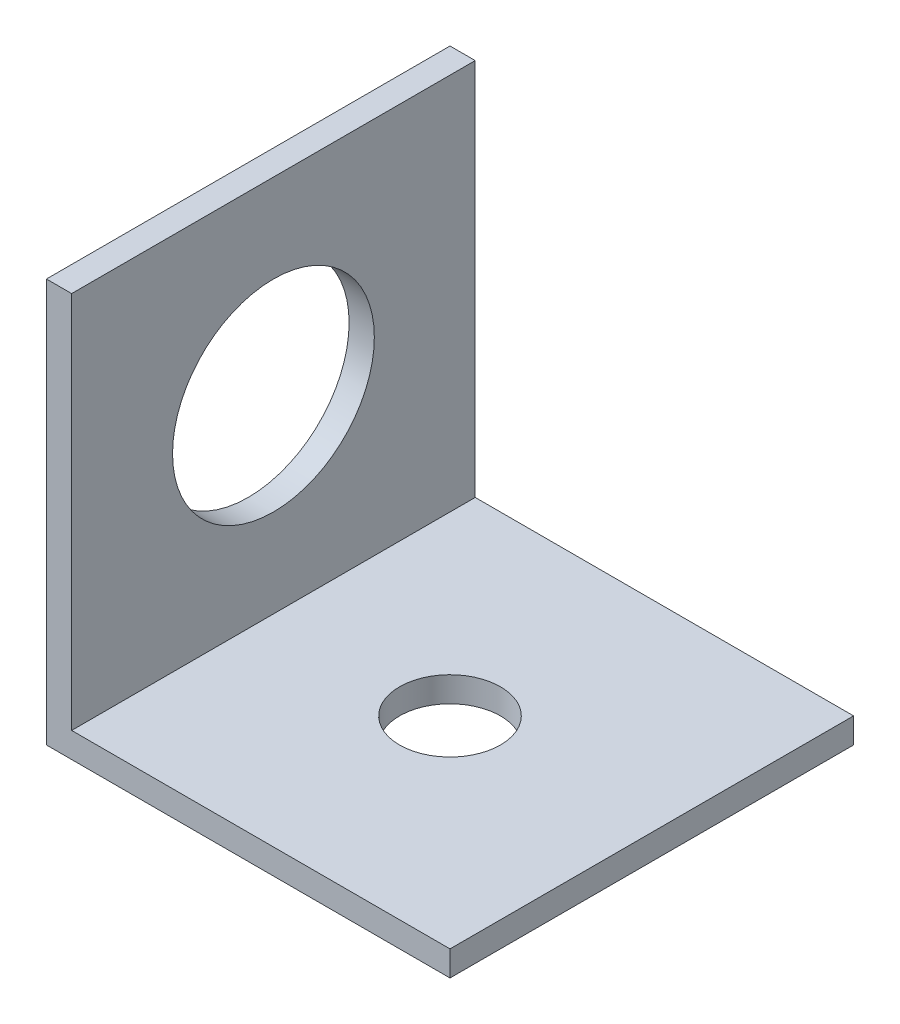
ISO-10303-21;
HEADER;
FILE_DESCRIPTION(('STEP AP214'),'2;1');
FILE_NAME('part.step','',(''),(''),'','','');
FILE_SCHEMA(('AUTOMOTIVE_DESIGN { 1 0 10303 214 1 1 1 1 }'));
ENDSEC;
DATA;
#1=APPLICATION_CONTEXT('core data for automotive mechanical design processes');
#2=APPLICATION_PROTOCOL_DEFINITION('international standard','automotive_design',2000,#1);
#3=PRODUCT_CONTEXT('',#1,'mechanical');
#4=PRODUCT('Part','Part','',(#3));
#5=PRODUCT_RELATED_PRODUCT_CATEGORY('part','',(#4));
#6=PRODUCT_DEFINITION_FORMATION('','',#4);
#7=PRODUCT_DEFINITION_CONTEXT('part definition',#1,'design');
#8=PRODUCT_DEFINITION('design','',#6,#7);
#9=PRODUCT_DEFINITION_SHAPE('','',#8);
#10=(LENGTH_UNIT() NAMED_UNIT(*) SI_UNIT(.MILLI.,.METRE.));
#11=(NAMED_UNIT(*) PLANE_ANGLE_UNIT() SI_UNIT($,.RADIAN.));
#12=(NAMED_UNIT(*) SI_UNIT($,.STERADIAN.) SOLID_ANGLE_UNIT());
#13=UNCERTAINTY_MEASURE_WITH_UNIT(LENGTH_MEASURE(1.E-05),#10,'distance_accuracy_value','');
#14=(GEOMETRIC_REPRESENTATION_CONTEXT(3) GLOBAL_UNCERTAINTY_ASSIGNED_CONTEXT((#13)) GLOBAL_UNIT_ASSIGNED_CONTEXT((#10,
#11,#12)) REPRESENTATION_CONTEXT('',''));
#15=CARTESIAN_POINT('',(0.,0.,0.));
#16=DIRECTION('',(0.,0.,1.));
#17=DIRECTION('',(1.,0.,0.));
#18=AXIS2_PLACEMENT_3D('',#15,#16,#17);
#19=CARTESIAN_POINT('',(25.4,0.,25.4));
#20=DIRECTION('',(0.,1.,0.));
#21=DIRECTION('',(0.,0.,1.));
#22=AXIS2_PLACEMENT_3D('',#19,#20,#21);
#23=PLANE('',#22);
#24=CARTESIAN_POINT('',(12.7,0.,12.7));
#25=DIRECTION('',(0.,1.,0.));
#26=DIRECTION('',(0.,0.,1.));
#27=AXIS2_PLACEMENT_3D('',#24,#25,#26);
#28=CIRCLE('',#27,3.175);
#29=CARTESIAN_POINT('',(12.7,0.,15.875));
#30=VERTEX_POINT('',#29);
#31=EDGE_CURVE('E125',#30,#30,#28,.T.);
#32=ORIENTED_EDGE('',*,*,#31,.T.);
#33=EDGE_LOOP('',(#32));
#34=FACE_BOUND('',#33,.T.);
#35=DIRECTION('',(1.,0.,0.));
#36=VECTOR('',#35,1.);
#37=CARTESIAN_POINT('',(25.4,0.,0.));
#38=LINE('',#37,#36);
#39=CARTESIAN_POINT('',(0.,0.,0.));
#40=VERTEX_POINT('',#39);
#41=CARTESIAN_POINT('',(25.4,0.,0.));
#42=VERTEX_POINT('',#41);
#43=EDGE_CURVE('E121',#40,#42,#38,.T.);
#44=ORIENTED_EDGE('',*,*,#43,.T.);
#45=DIRECTION('',(0.,0.,-1.));
#46=VECTOR('',#45,1.);
#47=CARTESIAN_POINT('',(25.4,0.,25.4));
#48=LINE('',#47,#46);
#49=CARTESIAN_POINT('',(25.4,0.,25.4));
#50=VERTEX_POINT('',#49);
#51=EDGE_CURVE('E11',#50,#42,#48,.T.);
#52=ORIENTED_EDGE('',*,*,#51,.F.);
#53=DIRECTION('',(1.,0.,0.));
#54=VECTOR('',#53,1.);
#55=CARTESIAN_POINT('',(25.4,0.,25.4));
#56=LINE('',#55,#54);
#57=CARTESIAN_POINT('',(0.,0.,25.4));
#58=VERTEX_POINT('',#57);
#59=EDGE_CURVE('E132',#58,#50,#56,.T.);
#60=ORIENTED_EDGE('',*,*,#59,.F.);
#61=DIRECTION('',(0.,0.,-1.));
#62=VECTOR('',#61,1.);
#63=CARTESIAN_POINT('',(0.,0.,25.4));
#64=LINE('',#63,#62);
#65=EDGE_CURVE('E117',#58,#40,#64,.T.);
#66=ORIENTED_EDGE('',*,*,#65,.T.);
#67=EDGE_LOOP('',(#44,#52,#60,#66));
#68=FACE_BOUND('',#67,.T.);
#69=ADVANCED_FACE('F36',(#34,#68),#23,.F.);
#70=CARTESIAN_POINT('',(25.4,1.5875,25.4));
#71=DIRECTION('',(-1.,0.,0.));
#72=DIRECTION('',(0.,0.,1.));
#73=AXIS2_PLACEMENT_3D('',#70,#71,#72);
#74=PLANE('',#73);
#75=DIRECTION('',(0.,1.,0.));
#76=VECTOR('',#75,1.);
#77=CARTESIAN_POINT('',(25.4,1.5875,0.));
#78=LINE('',#77,#76);
#79=CARTESIAN_POINT('',(25.4,1.5875,0.));
#80=VERTEX_POINT('',#79);
#81=EDGE_CURVE('E124',#42,#80,#78,.T.);
#82=ORIENTED_EDGE('',*,*,#81,.T.);
#83=DIRECTION('',(0.,0.,-1.));
#84=VECTOR('',#83,1.);
#85=CARTESIAN_POINT('',(25.4,1.5875,25.4));
#86=LINE('',#85,#84);
#87=CARTESIAN_POINT('',(25.4,1.5875,25.4));
#88=VERTEX_POINT('',#87);
#89=EDGE_CURVE('E45',#88,#80,#86,.T.);
#90=ORIENTED_EDGE('',*,*,#89,.F.);
#91=DIRECTION('',(0.,1.,0.));
#92=VECTOR('',#91,1.);
#93=CARTESIAN_POINT('',(25.4,1.5875,25.4));
#94=LINE('',#93,#92);
#95=EDGE_CURVE('E90',#50,#88,#94,.T.);
#96=ORIENTED_EDGE('',*,*,#95,.F.);
#97=ORIENTED_EDGE('',*,*,#51,.T.);
#98=EDGE_LOOP('',(#82,#90,#96,#97));
#99=FACE_BOUND('',#98,.T.);
#100=ADVANCED_FACE('F159',(#99),#74,.F.);
#101=CARTESIAN_POINT('',(1.5875,1.5875,25.4));
#102=DIRECTION('',(0.,-1.,0.));
#103=DIRECTION('',(0.,0.,-1.));
#104=AXIS2_PLACEMENT_3D('',#101,#102,#103);
#105=PLANE('',#104);
#106=CARTESIAN_POINT('',(12.7,1.5875,12.7));
#107=DIRECTION('',(0.,1.,0.));
#108=DIRECTION('',(0.,0.,1.));
#109=AXIS2_PLACEMENT_3D('',#106,#107,#108);
#110=CIRCLE('',#109,3.175);
#111=CARTESIAN_POINT('',(12.7,1.5875,15.875));
#112=VERTEX_POINT('',#111);
#113=EDGE_CURVE('E167',#112,#112,#110,.T.);
#114=ORIENTED_EDGE('',*,*,#113,.F.);
#115=EDGE_LOOP('',(#114));
#116=FACE_BOUND('',#115,.T.);
#117=DIRECTION('',(-1.,0.,0.));
#118=VECTOR('',#117,1.);
#119=CARTESIAN_POINT('',(1.5875,1.5875,0.));
#120=LINE('',#119,#118);
#121=CARTESIAN_POINT('',(1.5875,1.5875,0.));
#122=VERTEX_POINT('',#121);
#123=EDGE_CURVE('E127',#80,#122,#120,.T.);
#124=ORIENTED_EDGE('',*,*,#123,.T.);
#125=DIRECTION('',(0.,0.,-1.));
#126=VECTOR('',#125,1.);
#127=CARTESIAN_POINT('',(1.5875,1.5875,25.4));
#128=LINE('',#127,#126);
#129=CARTESIAN_POINT('',(1.5875,1.5875,25.4));
#130=VERTEX_POINT('',#129);
#131=EDGE_CURVE('E112',#130,#122,#128,.T.);
#132=ORIENTED_EDGE('',*,*,#131,.F.);
#133=DIRECTION('',(-1.,0.,0.));
#134=VECTOR('',#133,1.);
#135=CARTESIAN_POINT('',(1.5875,1.5875,25.4));
#136=LINE('',#135,#134);
#137=EDGE_CURVE('E103',#88,#130,#136,.T.);
#138=ORIENTED_EDGE('',*,*,#137,.F.);
#139=ORIENTED_EDGE('',*,*,#89,.T.);
#140=EDGE_LOOP('',(#124,#132,#138,#139));
#141=FACE_BOUND('',#140,.T.);
#142=ADVANCED_FACE('F139',(#116,#141),#105,.F.);
#143=CARTESIAN_POINT('',(1.5875,25.4,25.4));
#144=DIRECTION('',(-1.,0.,0.));
#145=DIRECTION('',(0.,-1.,0.));
#146=AXIS2_PLACEMENT_3D('',#143,#144,#145);
#147=PLANE('',#146);
#148=CARTESIAN_POINT('',(1.5875,13.49375,12.7));
#149=DIRECTION('',(1.,0.,0.));
#150=DIRECTION('',(0.,1.,0.));
#151=AXIS2_PLACEMENT_3D('',#148,#149,#150);
#152=CIRCLE('',#151,6.35);
#153=CARTESIAN_POINT('',(1.5875,19.84375,12.7));
#154=VERTEX_POINT('',#153);
#155=EDGE_CURVE('E174',#154,#154,#152,.T.);
#156=ORIENTED_EDGE('',*,*,#155,.F.);
#157=EDGE_LOOP('',(#156));
#158=FACE_BOUND('',#157,.T.);
#159=DIRECTION('',(0.,1.,0.));
#160=VECTOR('',#159,1.);
#161=CARTESIAN_POINT('',(1.5875,25.4,0.));
#162=LINE('',#161,#160);
#163=CARTESIAN_POINT('',(1.5875,25.4,0.));
#164=VERTEX_POINT('',#163);
#165=EDGE_CURVE('E111',#122,#164,#162,.T.);
#166=ORIENTED_EDGE('',*,*,#165,.T.);
#167=DIRECTION('',(0.,0.,-1.));
#168=VECTOR('',#167,1.);
#169=CARTESIAN_POINT('',(1.5875,25.4,25.4));
#170=LINE('',#169,#168);
#171=CARTESIAN_POINT('',(1.5875,25.4,25.4));
#172=VERTEX_POINT('',#171);
#173=EDGE_CURVE('E108',#172,#164,#170,.T.);
#174=ORIENTED_EDGE('',*,*,#173,.F.);
#175=DIRECTION('',(0.,1.,0.));
#176=VECTOR('',#175,1.);
#177=CARTESIAN_POINT('',(1.5875,25.4,25.4));
#178=LINE('',#177,#176);
#179=EDGE_CURVE('E97',#130,#172,#178,.T.);
#180=ORIENTED_EDGE('',*,*,#179,.F.);
#181=ORIENTED_EDGE('',*,*,#131,.T.);
#182=EDGE_LOOP('',(#166,#174,#180,#181));
#183=FACE_BOUND('',#182,.T.);
#184=ADVANCED_FACE('F109',(#158,#183),#147,.F.);
#185=CARTESIAN_POINT('',(0.,25.4,25.4));
#186=DIRECTION('',(0.,-1.,0.));
#187=DIRECTION('',(0.,0.,-1.));
#188=AXIS2_PLACEMENT_3D('',#185,#186,#187);
#189=PLANE('',#188);
#190=DIRECTION('',(-1.,0.,0.));
#191=VECTOR('',#190,1.);
#192=CARTESIAN_POINT('',(0.,25.4,0.));
#193=LINE('',#192,#191);
#194=CARTESIAN_POINT('',(0.,25.4,0.));
#195=VERTEX_POINT('',#194);
#196=EDGE_CURVE('E76',#164,#195,#193,.T.);
#197=ORIENTED_EDGE('',*,*,#196,.T.);
#198=DIRECTION('',(0.,0.,-1.));
#199=VECTOR('',#198,1.);
#200=CARTESIAN_POINT('',(0.,25.4,25.4));
#201=LINE('',#200,#199);
#202=CARTESIAN_POINT('',(0.,25.4,25.4));
#203=VERTEX_POINT('',#202);
#204=EDGE_CURVE('E113',#203,#195,#201,.T.);
#205=ORIENTED_EDGE('',*,*,#204,.F.);
#206=DIRECTION('',(-1.,0.,0.));
#207=VECTOR('',#206,1.);
#208=CARTESIAN_POINT('',(0.,25.4,25.4));
#209=LINE('',#208,#207);
#210=EDGE_CURVE('E101',#172,#203,#209,.T.);
#211=ORIENTED_EDGE('',*,*,#210,.F.);
#212=ORIENTED_EDGE('',*,*,#173,.T.);
#213=EDGE_LOOP('',(#197,#205,#211,#212));
#214=FACE_BOUND('',#213,.T.);
#215=ADVANCED_FACE('F115',(#214),#189,.F.);
#216=CARTESIAN_POINT('',(0.,0.,25.4));
#217=DIRECTION('',(1.,0.,0.));
#218=DIRECTION('',(0.,0.,-1.));
#219=AXIS2_PLACEMENT_3D('',#216,#217,#218);
#220=PLANE('',#219);
#221=CARTESIAN_POINT('',(0.,13.49375,12.7));
#222=DIRECTION('',(1.,0.,0.));
#223=DIRECTION('',(0.,0.,-1.));
#224=AXIS2_PLACEMENT_3D('',#221,#222,#223);
#225=CIRCLE('',#224,6.35);
#226=CARTESIAN_POINT('',(0.,13.49375,6.35));
#227=VERTEX_POINT('',#226);
#228=EDGE_CURVE('E39',#227,#227,#225,.T.);
#229=ORIENTED_EDGE('',*,*,#228,.T.);
#230=EDGE_LOOP('',(#229));
#231=FACE_BOUND('',#230,.T.);
#232=DIRECTION('',(0.,-1.,0.));
#233=VECTOR('',#232,1.);
#234=CARTESIAN_POINT('',(0.,0.,0.));
#235=LINE('',#234,#233);
#236=EDGE_CURVE('E82',#195,#40,#235,.T.);
#237=ORIENTED_EDGE('',*,*,#236,.T.);
#238=ORIENTED_EDGE('',*,*,#65,.F.);
#239=DIRECTION('',(0.,-1.,0.));
#240=VECTOR('',#239,1.);
#241=CARTESIAN_POINT('',(0.,0.,25.4));
#242=LINE('',#241,#240);
#243=EDGE_CURVE('E53',#203,#58,#242,.T.);
#244=ORIENTED_EDGE('',*,*,#243,.F.);
#245=ORIENTED_EDGE('',*,*,#204,.T.);
#246=EDGE_LOOP('',(#237,#238,#244,#245));
#247=FACE_BOUND('',#246,.T.);
#248=ADVANCED_FACE('F146',(#231,#247),#220,.F.);
#249=CARTESIAN_POINT('',(0.,0.,25.4));
#250=DIRECTION('',(0.,0.,-1.));
#251=DIRECTION('',(-1.,0.,0.));
#252=AXIS2_PLACEMENT_3D('',#249,#250,#251);
#253=PLANE('',#252);
#254=ORIENTED_EDGE('',*,*,#59,.T.);
#255=ORIENTED_EDGE('',*,*,#95,.T.);
#256=ORIENTED_EDGE('',*,*,#137,.T.);
#257=ORIENTED_EDGE('',*,*,#179,.T.);
#258=ORIENTED_EDGE('',*,*,#210,.T.);
#259=ORIENTED_EDGE('',*,*,#243,.T.);
#260=EDGE_LOOP('',(#254,#255,#256,#257,#258,#259));
#261=FACE_BOUND('',#260,.T.);
#262=ADVANCED_FACE('F99',(#261),#253,.F.);
#263=CARTESIAN_POINT('',(0.,0.,0.));
#264=DIRECTION('',(0.,0.,-1.));
#265=DIRECTION('',(-1.,0.,0.));
#266=AXIS2_PLACEMENT_3D('',#263,#264,#265);
#267=PLANE('',#266);
#268=ORIENTED_EDGE('',*,*,#43,.F.);
#269=ORIENTED_EDGE('',*,*,#236,.F.);
#270=ORIENTED_EDGE('',*,*,#196,.F.);
#271=ORIENTED_EDGE('',*,*,#165,.F.);
#272=ORIENTED_EDGE('',*,*,#123,.F.);
#273=ORIENTED_EDGE('',*,*,#81,.F.);
#274=EDGE_LOOP('',(#268,#269,#270,#271,#272,#273));
#275=FACE_BOUND('',#274,.T.);
#276=ADVANCED_FACE('F142',(#275),#267,.T.);
#277=CARTESIAN_POINT('',(12.7,-23.8125,12.7));
#278=DIRECTION('',(0.,1.,0.));
#279=DIRECTION('',(0.,0.,1.));
#280=AXIS2_PLACEMENT_3D('',#277,#278,#279);
#281=CYLINDRICAL_SURFACE('',#280,3.175);
#282=ORIENTED_EDGE('',*,*,#113,.T.);
#283=EDGE_LOOP('',(#282));
#284=FACE_BOUND('',#283,.T.);
#285=ORIENTED_EDGE('',*,*,#31,.F.);
#286=EDGE_LOOP('',(#285));
#287=FACE_BOUND('',#286,.T.);
#288=ADVANCED_FACE('F182',(#284,#287),#281,.F.);
#289=CARTESIAN_POINT('',(-23.8125,13.49375,12.7));
#290=DIRECTION('',(1.,0.,0.));
#291=DIRECTION('',(0.,1.,0.));
#292=AXIS2_PLACEMENT_3D('',#289,#290,#291);
#293=CYLINDRICAL_SURFACE('',#292,6.35);
#294=ORIENTED_EDGE('',*,*,#155,.T.);
#295=EDGE_LOOP('',(#294));
#296=FACE_BOUND('',#295,.T.);
#297=ORIENTED_EDGE('',*,*,#228,.F.);
#298=EDGE_LOOP('',(#297));
#299=FACE_BOUND('',#298,.T.);
#300=ADVANCED_FACE('F180',(#296,#299),#293,.F.);
#301=CLOSED_SHELL('',(#69,#100,#142,#184,#215,#248,#262,#276,#288,#300));
#302=MANIFOLD_SOLID_BREP('B2',#301);
#303=ADVANCED_BREP_SHAPE_REPRESENTATION('',(#18,#302),#14);
#304=SHAPE_DEFINITION_REPRESENTATION(#9,#303);
ENDSEC;
END-ISO-10303-21;
